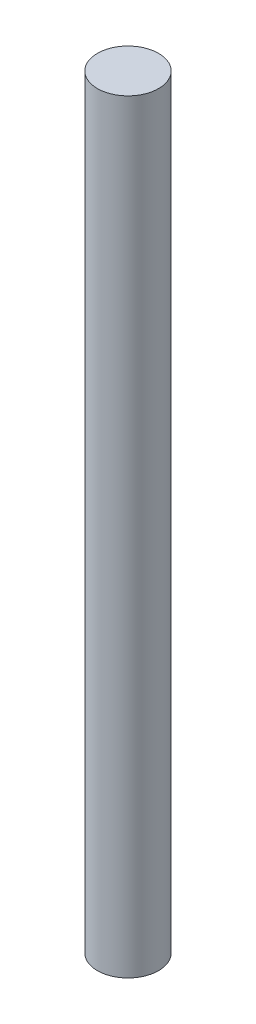
ISO-10303-21;
HEADER;
FILE_DESCRIPTION(('STEP AP214'),'2;1');
FILE_NAME('part.step','',(''),(''),'','','');
FILE_SCHEMA(('AUTOMOTIVE_DESIGN { 1 0 10303 214 1 1 1 1 }'));
ENDSEC;
DATA;
#1=APPLICATION_CONTEXT('core data for automotive mechanical design processes');
#2=APPLICATION_PROTOCOL_DEFINITION('international standard','automotive_design',2000,#1);
#3=PRODUCT_CONTEXT('',#1,'mechanical');
#4=PRODUCT('Part','Part','',(#3));
#5=PRODUCT_RELATED_PRODUCT_CATEGORY('part','',(#4));
#6=PRODUCT_DEFINITION_FORMATION('','',#4);
#7=PRODUCT_DEFINITION_CONTEXT('part definition',#1,'design');
#8=PRODUCT_DEFINITION('design','',#6,#7);
#9=PRODUCT_DEFINITION_SHAPE('','',#8);
#10=(LENGTH_UNIT() NAMED_UNIT(*) SI_UNIT(.MILLI.,.METRE.));
#11=(NAMED_UNIT(*) PLANE_ANGLE_UNIT() SI_UNIT($,.RADIAN.));
#12=(NAMED_UNIT(*) SI_UNIT($,.STERADIAN.) SOLID_ANGLE_UNIT());
#13=UNCERTAINTY_MEASURE_WITH_UNIT(LENGTH_MEASURE(1.E-05),#10,'distance_accuracy_value','');
#14=(GEOMETRIC_REPRESENTATION_CONTEXT(3) GLOBAL_UNCERTAINTY_ASSIGNED_CONTEXT((#13)) GLOBAL_UNIT_ASSIGNED_CONTEXT((#10,
#11,#12)) REPRESENTATION_CONTEXT('',''));
#15=CARTESIAN_POINT('',(0.,0.,0.));
#16=DIRECTION('',(0.,0.,1.));
#17=DIRECTION('',(1.,0.,0.));
#18=AXIS2_PLACEMENT_3D('',#15,#16,#17);
#19=CARTESIAN_POINT('',(0.,50.,0.));
#20=DIRECTION('',(0.,-1.,0.));
#21=DIRECTION('',(0.,0.,-1.));
#22=AXIS2_PLACEMENT_3D('',#19,#20,#21);
#23=CYLINDRICAL_SURFACE('',#22,2.);
#24=CARTESIAN_POINT('',(0.,50.,0.));
#25=DIRECTION('',(0.,1.,0.));
#26=DIRECTION('',(0.,0.,1.));
#27=AXIS2_PLACEMENT_3D('',#24,#25,#26);
#28=CIRCLE('',#27,2.);
#29=CARTESIAN_POINT('',(0.,50.,2.));
#30=VERTEX_POINT('',#29);
#31=EDGE_CURVE('E10',#30,#30,#28,.T.);
#32=ORIENTED_EDGE('',*,*,#31,.F.);
#33=EDGE_LOOP('',(#32));
#34=FACE_BOUND('',#33,.T.);
#35=CARTESIAN_POINT('',(0.,0.,0.));
#36=DIRECTION('',(0.,1.,0.));
#37=DIRECTION('',(0.,0.,1.));
#38=AXIS2_PLACEMENT_3D('',#35,#36,#37);
#39=CIRCLE('',#38,2.);
#40=CARTESIAN_POINT('',(0.,0.,2.));
#41=VERTEX_POINT('',#40);
#42=EDGE_CURVE('E40',#41,#41,#39,.T.);
#43=ORIENTED_EDGE('',*,*,#42,.T.);
#44=EDGE_LOOP('',(#43));
#45=FACE_BOUND('',#44,.T.);
#46=ADVANCED_FACE('F37',(#34,#45),#23,.T.);
#47=CARTESIAN_POINT('',(0.,50.,0.));
#48=DIRECTION('',(0.,1.,0.));
#49=DIRECTION('',(0.,0.,1.));
#50=AXIS2_PLACEMENT_3D('',#47,#48,#49);
#51=PLANE('',#50);
#52=ORIENTED_EDGE('',*,*,#31,.T.);
#53=EDGE_LOOP('',(#52));
#54=FACE_BOUND('',#53,.T.);
#55=ADVANCED_FACE('F54',(#54),#51,.T.);
#56=CARTESIAN_POINT('',(0.,0.,0.));
#57=DIRECTION('',(0.,1.,0.));
#58=DIRECTION('',(0.,0.,1.));
#59=AXIS2_PLACEMENT_3D('',#56,#57,#58);
#60=PLANE('',#59);
#61=ORIENTED_EDGE('',*,*,#42,.F.);
#62=EDGE_LOOP('',(#61));
#63=FACE_BOUND('',#62,.T.);
#64=ADVANCED_FACE('F52',(#63),#60,.F.);
#65=CLOSED_SHELL('',(#46,#55,#64));
#66=MANIFOLD_SOLID_BREP('B2',#65);
#67=ADVANCED_BREP_SHAPE_REPRESENTATION('',(#18,#66),#14);
#68=SHAPE_DEFINITION_REPRESENTATION(#9,#67);
ENDSEC;
END-ISO-10303-21;
